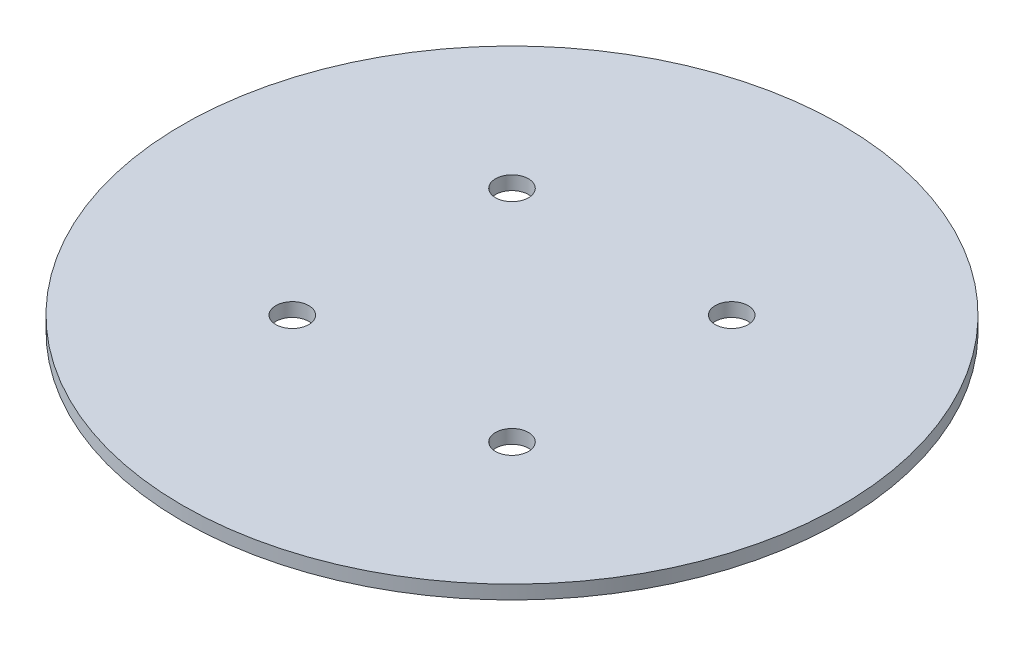
ISO-10303-21;
HEADER;
FILE_DESCRIPTION(('STEP AP214'),'2;1');
FILE_NAME('part.step','',(''),(''),'','','');
FILE_SCHEMA(('AUTOMOTIVE_DESIGN { 1 0 10303 214 1 1 1 1 }'));
ENDSEC;
DATA;
#1=APPLICATION_CONTEXT('core data for automotive mechanical design processes');
#2=APPLICATION_PROTOCOL_DEFINITION('international standard','automotive_design',2000,#1);
#3=PRODUCT_CONTEXT('',#1,'mechanical');
#4=PRODUCT('Part','Part','',(#3));
#5=PRODUCT_RELATED_PRODUCT_CATEGORY('part','',(#4));
#6=PRODUCT_DEFINITION_FORMATION('','',#4);
#7=PRODUCT_DEFINITION_CONTEXT('part definition',#1,'design');
#8=PRODUCT_DEFINITION('design','',#6,#7);
#9=PRODUCT_DEFINITION_SHAPE('','',#8);
#10=(LENGTH_UNIT() NAMED_UNIT(*) SI_UNIT(.MILLI.,.METRE.));
#11=(NAMED_UNIT(*) PLANE_ANGLE_UNIT() SI_UNIT($,.RADIAN.));
#12=(NAMED_UNIT(*) SI_UNIT($,.STERADIAN.) SOLID_ANGLE_UNIT());
#13=UNCERTAINTY_MEASURE_WITH_UNIT(LENGTH_MEASURE(1.E-05),#10,'distance_accuracy_value','');
#14=(GEOMETRIC_REPRESENTATION_CONTEXT(3) GLOBAL_UNCERTAINTY_ASSIGNED_CONTEXT((#13)) GLOBAL_UNIT_ASSIGNED_CONTEXT((#10,
#11,#12)) REPRESENTATION_CONTEXT('',''));
#15=CARTESIAN_POINT('',(0.,0.,0.));
#16=DIRECTION('',(0.,0.,1.));
#17=DIRECTION('',(1.,0.,0.));
#18=AXIS2_PLACEMENT_3D('',#15,#16,#17);
#19=CARTESIAN_POINT('',(0.,3.175,0.));
#20=DIRECTION('',(0.,1.,0.));
#21=DIRECTION('',(0.,0.,1.));
#22=AXIS2_PLACEMENT_3D('',#19,#20,#21);
#23=PLANE('',#22);
#24=CARTESIAN_POINT('',(25.4,3.175,25.4));
#25=DIRECTION('',(0.,1.,0.));
#26=DIRECTION('',(0.,0.,1.));
#27=AXIS2_PLACEMENT_3D('',#24,#25,#26);
#28=CIRCLE('',#27,3.81);
#29=CARTESIAN_POINT('',(25.4,3.175,29.21));
#30=VERTEX_POINT('',#29);
#31=EDGE_CURVE('E53',#30,#30,#28,.T.);
#32=ORIENTED_EDGE('',*,*,#31,.F.);
#33=EDGE_LOOP('',(#32));
#34=FACE_BOUND('',#33,.T.);
#35=CARTESIAN_POINT('',(-25.4,3.175,-25.4));
#36=DIRECTION('',(0.,1.,0.));
#37=DIRECTION('',(0.,0.,1.));
#38=AXIS2_PLACEMENT_3D('',#35,#36,#37);
#39=CIRCLE('',#38,3.81);
#40=CARTESIAN_POINT('',(-25.4,3.175,-21.59));
#41=VERTEX_POINT('',#40);
#42=EDGE_CURVE('E42',#41,#41,#39,.T.);
#43=ORIENTED_EDGE('',*,*,#42,.F.);
#44=EDGE_LOOP('',(#43));
#45=FACE_BOUND('',#44,.T.);
#46=CARTESIAN_POINT('',(0.,3.175,0.));
#47=DIRECTION('',(0.,1.,0.));
#48=DIRECTION('',(0.,0.,1.));
#49=AXIS2_PLACEMENT_3D('',#46,#47,#48);
#50=CIRCLE('',#49,76.2);
#51=CARTESIAN_POINT('',(0.,3.175,76.2));
#52=VERTEX_POINT('',#51);
#53=EDGE_CURVE('E10',#52,#52,#50,.T.);
#54=ORIENTED_EDGE('',*,*,#53,.T.);
#55=EDGE_LOOP('',(#54));
#56=FACE_BOUND('',#55,.T.);
#57=CARTESIAN_POINT('',(-25.4,3.175,25.4));
#58=DIRECTION('',(0.,1.,0.));
#59=DIRECTION('',(0.,0.,-1.));
#60=AXIS2_PLACEMENT_3D('',#57,#58,#59);
#61=CIRCLE('',#60,3.81);
#62=CARTESIAN_POINT('',(-25.4,3.175,21.59));
#63=VERTEX_POINT('',#62);
#64=EDGE_CURVE('E47',#63,#63,#61,.T.);
#65=ORIENTED_EDGE('',*,*,#64,.F.);
#66=EDGE_LOOP('',(#65));
#67=FACE_BOUND('',#66,.T.);
#68=CARTESIAN_POINT('',(25.4,3.175,-25.4));
#69=DIRECTION('',(0.,1.,0.));
#70=DIRECTION('',(0.,0.,-1.));
#71=AXIS2_PLACEMENT_3D('',#68,#69,#70);
#72=CIRCLE('',#71,3.81);
#73=CARTESIAN_POINT('',(25.4,3.175,-29.21));
#74=VERTEX_POINT('',#73);
#75=EDGE_CURVE('E59',#74,#74,#72,.T.);
#76=ORIENTED_EDGE('',*,*,#75,.F.);
#77=EDGE_LOOP('',(#76));
#78=FACE_BOUND('',#77,.T.);
#79=ADVANCED_FACE('F31',(#34,#45,#56,#67,#78),#23,.T.);
#80=CARTESIAN_POINT('',(0.,0.,0.));
#81=DIRECTION('',(0.,1.,0.));
#82=DIRECTION('',(0.,0.,1.));
#83=AXIS2_PLACEMENT_3D('',#80,#81,#82);
#84=PLANE('',#83);
#85=CARTESIAN_POINT('',(25.4,0.,25.4));
#86=DIRECTION('',(0.,1.,0.));
#87=DIRECTION('',(0.,0.,1.));
#88=AXIS2_PLACEMENT_3D('',#85,#86,#87);
#89=CIRCLE('',#88,3.81);
#90=CARTESIAN_POINT('',(25.4,0.,29.21));
#91=VERTEX_POINT('',#90);
#92=EDGE_CURVE('E56',#91,#91,#89,.T.);
#93=ORIENTED_EDGE('',*,*,#92,.T.);
#94=EDGE_LOOP('',(#93));
#95=FACE_BOUND('',#94,.T.);
#96=CARTESIAN_POINT('',(-25.4,0.,-25.4));
#97=DIRECTION('',(0.,1.,0.));
#98=DIRECTION('',(0.,0.,1.));
#99=AXIS2_PLACEMENT_3D('',#96,#97,#98);
#100=CIRCLE('',#99,3.81);
#101=CARTESIAN_POINT('',(-25.4,0.,-21.59));
#102=VERTEX_POINT('',#101);
#103=EDGE_CURVE('E44',#102,#102,#100,.T.);
#104=ORIENTED_EDGE('',*,*,#103,.T.);
#105=EDGE_LOOP('',(#104));
#106=FACE_BOUND('',#105,.T.);
#107=CARTESIAN_POINT('',(0.,0.,0.));
#108=DIRECTION('',(0.,1.,0.));
#109=DIRECTION('',(0.,0.,1.));
#110=AXIS2_PLACEMENT_3D('',#107,#108,#109);
#111=CIRCLE('',#110,76.2);
#112=CARTESIAN_POINT('',(0.,0.,76.2));
#113=VERTEX_POINT('',#112);
#114=EDGE_CURVE('E35',#113,#113,#111,.T.);
#115=ORIENTED_EDGE('',*,*,#114,.F.);
#116=EDGE_LOOP('',(#115));
#117=FACE_BOUND('',#116,.T.);
#118=CARTESIAN_POINT('',(-25.4,0.,25.4));
#119=DIRECTION('',(0.,1.,0.));
#120=DIRECTION('',(0.,0.,-1.));
#121=AXIS2_PLACEMENT_3D('',#118,#119,#120);
#122=CIRCLE('',#121,3.81);
#123=CARTESIAN_POINT('',(-25.4,0.,21.59));
#124=VERTEX_POINT('',#123);
#125=EDGE_CURVE('E50',#124,#124,#122,.T.);
#126=ORIENTED_EDGE('',*,*,#125,.T.);
#127=EDGE_LOOP('',(#126));
#128=FACE_BOUND('',#127,.T.);
#129=CARTESIAN_POINT('',(25.4,0.,-25.4));
#130=DIRECTION('',(0.,1.,0.));
#131=DIRECTION('',(0.,0.,-1.));
#132=AXIS2_PLACEMENT_3D('',#129,#130,#131);
#133=CIRCLE('',#132,3.81);
#134=CARTESIAN_POINT('',(25.4,0.,-29.21));
#135=VERTEX_POINT('',#134);
#136=EDGE_CURVE('E62',#135,#135,#133,.T.);
#137=ORIENTED_EDGE('',*,*,#136,.T.);
#138=EDGE_LOOP('',(#137));
#139=FACE_BOUND('',#138,.T.);
#140=ADVANCED_FACE('F72',(#95,#106,#117,#128,#139),#84,.F.);
#141=CARTESIAN_POINT('',(0.,3.175,0.));
#142=DIRECTION('',(0.,-1.,0.));
#143=DIRECTION('',(0.,0.,-1.));
#144=AXIS2_PLACEMENT_3D('',#141,#142,#143);
#145=CYLINDRICAL_SURFACE('',#144,76.2);
#146=ORIENTED_EDGE('',*,*,#53,.F.);
#147=EDGE_LOOP('',(#146));
#148=FACE_BOUND('',#147,.T.);
#149=ORIENTED_EDGE('',*,*,#114,.T.);
#150=EDGE_LOOP('',(#149));
#151=FACE_BOUND('',#150,.T.);
#152=ADVANCED_FACE('F33',(#148,#151),#145,.T.);
#153=CARTESIAN_POINT('',(-25.4,3.175,-25.4));
#154=DIRECTION('',(0.,-1.,0.));
#155=DIRECTION('',(0.,0.,-1.));
#156=AXIS2_PLACEMENT_3D('',#153,#154,#155);
#157=CYLINDRICAL_SURFACE('',#156,3.81);
#158=ORIENTED_EDGE('',*,*,#42,.T.);
#159=EDGE_LOOP('',(#158));
#160=FACE_BOUND('',#159,.T.);
#161=ORIENTED_EDGE('',*,*,#103,.F.);
#162=EDGE_LOOP('',(#161));
#163=FACE_BOUND('',#162,.T.);
#164=ADVANCED_FACE('F82',(#160,#163),#157,.F.);
#165=CARTESIAN_POINT('',(-25.4,3.175,25.4));
#166=DIRECTION('',(0.,-1.,0.));
#167=DIRECTION('',(0.,0.,-1.));
#168=AXIS2_PLACEMENT_3D('',#165,#166,#167);
#169=CYLINDRICAL_SURFACE('',#168,3.81);
#170=ORIENTED_EDGE('',*,*,#64,.T.);
#171=EDGE_LOOP('',(#170));
#172=FACE_BOUND('',#171,.T.);
#173=ORIENTED_EDGE('',*,*,#125,.F.);
#174=EDGE_LOOP('',(#173));
#175=FACE_BOUND('',#174,.T.);
#176=ADVANCED_FACE('F85',(#172,#175),#169,.F.);
#177=CARTESIAN_POINT('',(25.4,3.175,25.4));
#178=DIRECTION('',(0.,-1.,0.));
#179=DIRECTION('',(0.,0.,-1.));
#180=AXIS2_PLACEMENT_3D('',#177,#178,#179);
#181=CYLINDRICAL_SURFACE('',#180,3.81);
#182=ORIENTED_EDGE('',*,*,#31,.T.);
#183=EDGE_LOOP('',(#182));
#184=FACE_BOUND('',#183,.T.);
#185=ORIENTED_EDGE('',*,*,#92,.F.);
#186=EDGE_LOOP('',(#185));
#187=FACE_BOUND('',#186,.T.);
#188=ADVANCED_FACE('F89',(#184,#187),#181,.F.);
#189=CARTESIAN_POINT('',(25.4,3.175,-25.4));
#190=DIRECTION('',(0.,-1.,0.));
#191=DIRECTION('',(0.,0.,-1.));
#192=AXIS2_PLACEMENT_3D('',#189,#190,#191);
#193=CYLINDRICAL_SURFACE('',#192,3.81);
#194=ORIENTED_EDGE('',*,*,#75,.T.);
#195=EDGE_LOOP('',(#194));
#196=FACE_BOUND('',#195,.T.);
#197=ORIENTED_EDGE('',*,*,#136,.F.);
#198=EDGE_LOOP('',(#197));
#199=FACE_BOUND('',#198,.T.);
#200=ADVANCED_FACE('F68',(#196,#199),#193,.F.);
#201=CLOSED_SHELL('',(#79,#140,#152,#164,#176,#188,#200));
#202=MANIFOLD_SOLID_BREP('B2',#201);
#203=ADVANCED_BREP_SHAPE_REPRESENTATION('',(#18,#202),#14);
#204=SHAPE_DEFINITION_REPRESENTATION(#9,#203);
ENDSEC;
END-ISO-10303-21;
